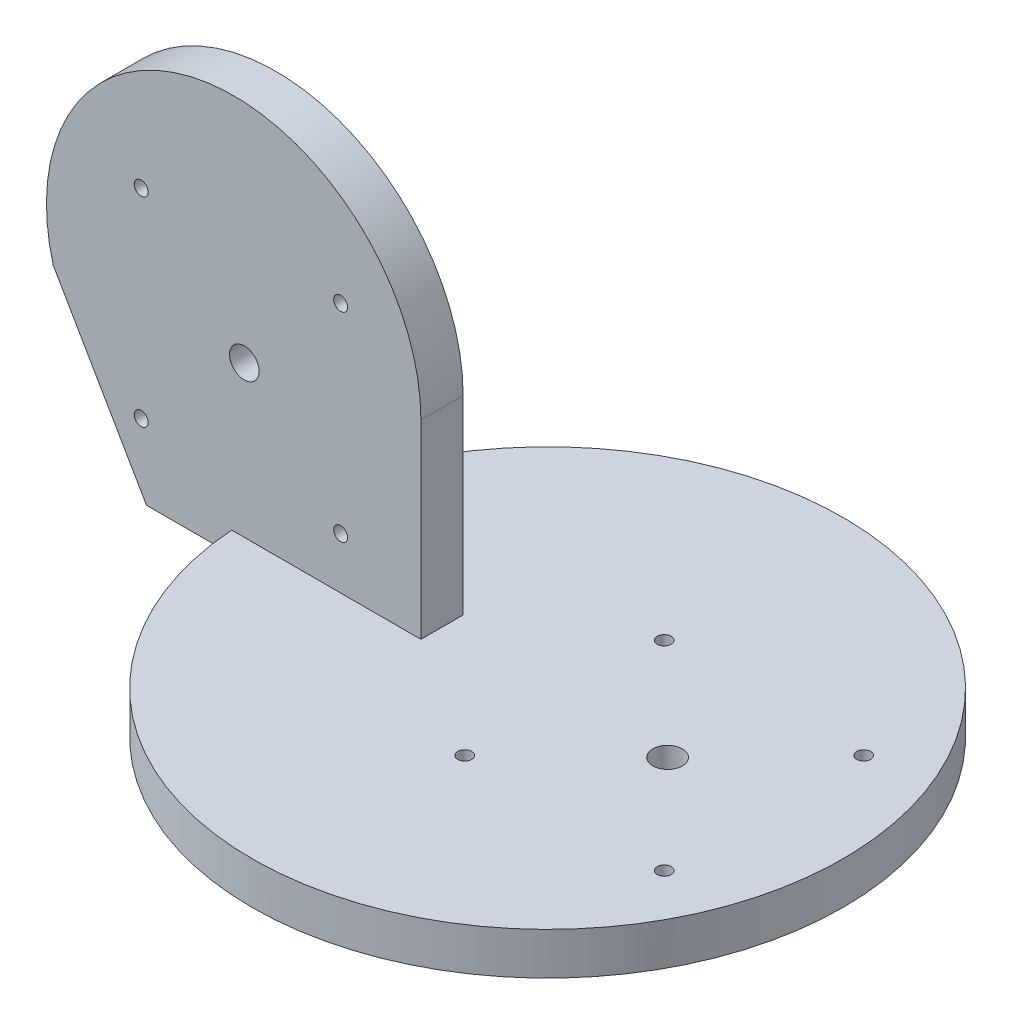
ISO-10303-21;
HEADER;
FILE_DESCRIPTION(('STEP AP214'),'2;1');
FILE_NAME('part.step','',(''),(''),'','','');
FILE_SCHEMA(('AUTOMOTIVE_DESIGN { 1 0 10303 214 1 1 1 1 }'));
ENDSEC;
DATA;
#1=APPLICATION_CONTEXT('core data for automotive mechanical design processes');
#2=APPLICATION_PROTOCOL_DEFINITION('international standard','automotive_design',2000,#1);
#3=PRODUCT_CONTEXT('',#1,'mechanical');
#4=PRODUCT('Part','Part','',(#3));
#5=PRODUCT_RELATED_PRODUCT_CATEGORY('part','',(#4));
#6=PRODUCT_DEFINITION_FORMATION('','',#4);
#7=PRODUCT_DEFINITION_CONTEXT('part definition',#1,'design');
#8=PRODUCT_DEFINITION('design','',#6,#7);
#9=PRODUCT_DEFINITION_SHAPE('','',#8);
#10=(LENGTH_UNIT() NAMED_UNIT(*) SI_UNIT(.MILLI.,.METRE.));
#11=(NAMED_UNIT(*) PLANE_ANGLE_UNIT() SI_UNIT($,.RADIAN.));
#12=(NAMED_UNIT(*) SI_UNIT($,.STERADIAN.) SOLID_ANGLE_UNIT());
#13=UNCERTAINTY_MEASURE_WITH_UNIT(LENGTH_MEASURE(1.E-05),#10,'distance_accuracy_value','');
#14=(GEOMETRIC_REPRESENTATION_CONTEXT(3) GLOBAL_UNCERTAINTY_ASSIGNED_CONTEXT((#13)) GLOBAL_UNIT_ASSIGNED_CONTEXT((#10,
#11,#12)) REPRESENTATION_CONTEXT('',''));
#15=CARTESIAN_POINT('',(0.,0.,0.));
#16=DIRECTION('',(0.,0.,1.));
#17=DIRECTION('',(1.,0.,0.));
#18=AXIS2_PLACEMENT_3D('',#15,#16,#17);
#19=CARTESIAN_POINT('',(0.,10.,0.));
#20=DIRECTION('',(0.,-1.,0.));
#21=DIRECTION('',(0.,0.,-1.));
#22=AXIS2_PLACEMENT_3D('',#19,#20,#21);
#23=CYLINDRICAL_SURFACE('',#22,70.);
#24=CARTESIAN_POINT('',(0.,0.,0.));
#25=DIRECTION('',(0.,1.,0.));
#26=DIRECTION('',(0.,0.,1.));
#27=AXIS2_PLACEMENT_3D('',#24,#25,#26);
#28=CIRCLE('',#27,70.);
#29=CARTESIAN_POINT('',(0.,0.,70.));
#30=VERTEX_POINT('',#29);
#31=EDGE_CURVE('E169',#30,#30,#28,.T.);
#32=ORIENTED_EDGE('',*,*,#31,.T.);
#33=EDGE_LOOP('',(#32));
#34=FACE_BOUND('',#33,.T.);
#35=DIRECTION('',(0.,-1.,0.));
#36=VECTOR('',#35,1.);
#37=CARTESIAN_POINT('',(-69.8212002188447,10.,5.));
#38=LINE('',#37,#36);
#39=CARTESIAN_POINT('',(-69.8212002188447,4.99999999999999,5.));
#40=VERTEX_POINT('',#39);
#41=CARTESIAN_POINT('',(-69.8212002188447,10.,5.));
#42=VERTEX_POINT('',#41);
#43=EDGE_CURVE('E53',#40,#42,#38,.F.);
#44=ORIENTED_EDGE('',*,*,#43,.F.);
#45=CARTESIAN_POINT('',(0.,5.,0.));
#46=DIRECTION('',(0.,1.,0.));
#47=DIRECTION('',(-1.,0.,0.));
#48=AXIS2_PLACEMENT_3D('',#45,#46,#47);
#49=CIRCLE('',#48,70.);
#50=CARTESIAN_POINT('',(-69.8212002188447,4.99999999999999,-5.));
#51=VERTEX_POINT('',#50);
#52=EDGE_CURVE('E11',#51,#40,#49,.T.);
#53=ORIENTED_EDGE('',*,*,#52,.F.);
#54=DIRECTION('',(0.,-1.,0.));
#55=VECTOR('',#54,1.);
#56=CARTESIAN_POINT('',(-69.8212002188447,10.,-5.));
#57=LINE('',#56,#55);
#58=CARTESIAN_POINT('',(-69.8212002188447,10.,-5.));
#59=VERTEX_POINT('',#58);
#60=EDGE_CURVE('E163',#51,#59,#57,.F.);
#61=ORIENTED_EDGE('',*,*,#60,.T.);
#62=CARTESIAN_POINT('',(0.,10.,0.));
#63=DIRECTION('',(0.,1.,0.));
#64=DIRECTION('',(0.,0.,1.));
#65=AXIS2_PLACEMENT_3D('',#62,#63,#64);
#66=CIRCLE('',#65,70.);
#67=EDGE_CURVE('E174',#42,#59,#66,.T.);
#68=ORIENTED_EDGE('',*,*,#67,.F.);
#69=EDGE_LOOP('',(#44,#53,#61,#68));
#70=FACE_BOUND('',#69,.T.);
#71=ADVANCED_FACE('F38',(#34,#70),#23,.T.);
#72=CARTESIAN_POINT('',(0.,10.,0.));
#73=DIRECTION('',(0.,1.,0.));
#74=DIRECTION('',(0.,0.,1.));
#75=AXIS2_PLACEMENT_3D('',#72,#73,#74);
#76=PLANE('',#75);
#77=CARTESIAN_POINT('',(28.4267988565162,10.,0.));
#78=DIRECTION('',(0.,1.,0.));
#79=DIRECTION('',(0.,0.,1.));
#80=AXIS2_PLACEMENT_3D('',#77,#78,#79);
#81=CIRCLE('',#80,3.49999999999999);
#82=CARTESIAN_POINT('',(28.4267988565162,10.,3.49999999999999));
#83=VERTEX_POINT('',#82);
#84=EDGE_CURVE('E252',#83,#83,#81,.T.);
#85=ORIENTED_EDGE('',*,*,#84,.F.);
#86=EDGE_LOOP('',(#85));
#87=FACE_BOUND('',#86,.T.);
#88=CARTESIAN_POINT('',(3.99999999999997,10.,-23.622));
#89=DIRECTION('',(0.,1.,0.));
#90=DIRECTION('',(0.,0.,1.));
#91=AXIS2_PLACEMENT_3D('',#88,#89,#90);
#92=CIRCLE('',#91,1.64999999999999);
#93=CARTESIAN_POINT('',(3.99999999999997,10.,-21.972));
#94=VERTEX_POINT('',#93);
#95=EDGE_CURVE('E110',#94,#94,#92,.T.);
#96=ORIENTED_EDGE('',*,*,#95,.F.);
#97=EDGE_LOOP('',(#96));
#98=FACE_BOUND('',#97,.T.);
#99=CARTESIAN_POINT('',(51.244,10.,-23.622));
#100=DIRECTION('',(0.,1.,0.));
#101=DIRECTION('',(0.,0.,1.));
#102=AXIS2_PLACEMENT_3D('',#99,#100,#101);
#103=CIRCLE('',#102,1.64999999999999);
#104=CARTESIAN_POINT('',(51.244,10.,-21.972));
#105=VERTEX_POINT('',#104);
#106=EDGE_CURVE('E109',#105,#105,#103,.T.);
#107=ORIENTED_EDGE('',*,*,#106,.F.);
#108=EDGE_LOOP('',(#107));
#109=FACE_BOUND('',#108,.T.);
#110=CARTESIAN_POINT('',(51.244,10.,23.622));
#111=DIRECTION('',(0.,1.,0.));
#112=DIRECTION('',(0.,0.,1.));
#113=AXIS2_PLACEMENT_3D('',#110,#111,#112);
#114=CIRCLE('',#113,1.64999999999999);
#115=CARTESIAN_POINT('',(51.244,10.,25.272));
#116=VERTEX_POINT('',#115);
#117=EDGE_CURVE('E122',#116,#116,#114,.T.);
#118=ORIENTED_EDGE('',*,*,#117,.F.);
#119=EDGE_LOOP('',(#118));
#120=FACE_BOUND('',#119,.T.);
#121=CARTESIAN_POINT('',(4.,10.,23.622));
#122=DIRECTION('',(0.,1.,0.));
#123=DIRECTION('',(0.,0.,1.));
#124=AXIS2_PLACEMENT_3D('',#121,#122,#123);
#125=CIRCLE('',#124,1.64999999999999);
#126=CARTESIAN_POINT('',(4.,10.,25.272));
#127=VERTEX_POINT('',#126);
#128=EDGE_CURVE('E128',#127,#127,#125,.T.);
#129=ORIENTED_EDGE('',*,*,#128,.F.);
#130=EDGE_LOOP('',(#129));
#131=FACE_BOUND('',#130,.T.);
#132=DIRECTION('',(0.,0.,1.));
#133=VECTOR('',#132,1.);
#134=CARTESIAN_POINT('',(-25.,10.,0.));
#135=LINE('',#134,#133);
#136=CARTESIAN_POINT('',(-25.,10.,-5.));
#137=VERTEX_POINT('',#136);
#138=CARTESIAN_POINT('',(-25.,10.,5.));
#139=VERTEX_POINT('',#138);
#140=EDGE_CURVE('E180',#137,#139,#135,.T.);
#141=ORIENTED_EDGE('',*,*,#140,.T.);
#142=DIRECTION('',(-1.,0.,0.));
#143=VECTOR('',#142,1.);
#144=CARTESIAN_POINT('',(0.,10.,5.));
#145=LINE('',#144,#143);
#146=EDGE_CURVE('E46',#139,#42,#145,.T.);
#147=ORIENTED_EDGE('',*,*,#146,.T.);
#148=ORIENTED_EDGE('',*,*,#67,.T.);
#149=DIRECTION('',(-1.,0.,0.));
#150=VECTOR('',#149,1.);
#151=CARTESIAN_POINT('',(0.,10.,-5.));
#152=LINE('',#151,#150);
#153=EDGE_CURVE('E173',#137,#59,#152,.T.);
#154=ORIENTED_EDGE('',*,*,#153,.F.);
#155=EDGE_LOOP('',(#141,#147,#148,#154));
#156=FACE_BOUND('',#155,.T.);
#157=ADVANCED_FACE('F184',(#87,#98,#109,#120,#131,#156),#76,.T.);
#158=CARTESIAN_POINT('',(0.,0.,0.));
#159=DIRECTION('',(0.,1.,0.));
#160=DIRECTION('',(0.,0.,1.));
#161=AXIS2_PLACEMENT_3D('',#158,#159,#160);
#162=PLANE('',#161);
#163=CARTESIAN_POINT('',(0.,0.,0.));
#164=DIRECTION('',(0.,-1.,0.));
#165=DIRECTION('',(0.,0.,-1.));
#166=AXIS2_PLACEMENT_3D('',#163,#164,#165);
#167=CIRCLE('',#166,65.);
#168=CARTESIAN_POINT('',(0.,0.,-65.));
#169=VERTEX_POINT('',#168);
#170=EDGE_CURVE('E170',#169,#169,#167,.T.);
#171=ORIENTED_EDGE('',*,*,#170,.F.);
#172=EDGE_LOOP('',(#171));
#173=FACE_BOUND('',#172,.T.);
#174=ORIENTED_EDGE('',*,*,#31,.F.);
#175=EDGE_LOOP('',(#174));
#176=FACE_BOUND('',#175,.T.);
#177=ADVANCED_FACE('F221',(#173,#176),#162,.F.);
#178=CARTESIAN_POINT('',(0.,-3.,0.));
#179=DIRECTION('',(0.,1.,0.));
#180=DIRECTION('',(0.,0.,1.));
#181=AXIS2_PLACEMENT_3D('',#178,#179,#180);
#182=CYLINDRICAL_SURFACE('',#181,65.);
#183=CARTESIAN_POINT('',(0.,-3.,0.));
#184=DIRECTION('',(0.,-1.,0.));
#185=DIRECTION('',(0.,0.,-1.));
#186=AXIS2_PLACEMENT_3D('',#183,#184,#185);
#187=CIRCLE('',#186,65.);
#188=CARTESIAN_POINT('',(0.,-3.,-65.));
#189=VERTEX_POINT('',#188);
#190=EDGE_CURVE('E166',#189,#189,#187,.T.);
#191=ORIENTED_EDGE('',*,*,#190,.F.);
#192=EDGE_LOOP('',(#191));
#193=FACE_BOUND('',#192,.T.);
#194=ORIENTED_EDGE('',*,*,#170,.T.);
#195=EDGE_LOOP('',(#194));
#196=FACE_BOUND('',#195,.T.);
#197=ADVANCED_FACE('F227',(#193,#196),#182,.T.);
#198=CARTESIAN_POINT('',(0.,-3.,0.));
#199=DIRECTION('',(0.,-1.,0.));
#200=DIRECTION('',(0.,0.,-1.));
#201=AXIS2_PLACEMENT_3D('',#198,#199,#200);
#202=PLANE('',#201);
#203=CARTESIAN_POINT('',(28.4267988565162,-3.,0.));
#204=DIRECTION('',(0.,1.,0.));
#205=DIRECTION('',(0.,0.,1.));
#206=AXIS2_PLACEMENT_3D('',#203,#204,#205);
#207=CIRCLE('',#206,3.5);
#208=CARTESIAN_POINT('',(28.4267988565162,-3.,3.5));
#209=VERTEX_POINT('',#208);
#210=EDGE_CURVE('E116',#209,#209,#207,.T.);
#211=ORIENTED_EDGE('',*,*,#210,.T.);
#212=EDGE_LOOP('',(#211));
#213=FACE_BOUND('',#212,.T.);
#214=ORIENTED_EDGE('',*,*,#190,.T.);
#215=EDGE_LOOP('',(#214));
#216=FACE_BOUND('',#215,.T.);
#217=ADVANCED_FACE('F232',(#213,#216),#202,.T.);
#218=CARTESIAN_POINT('',(-69.3458475312719,55.,5.));
#219=DIRECTION('',(0.,0.,-1.));
#220=DIRECTION('',(-1.,0.,0.));
#221=AXIS2_PLACEMENT_3D('',#218,#219,#220);
#222=PLANE('',#221);
#223=CARTESIAN_POINT('',(-66.8266224533388,45.7931765020589,5.));
#224=DIRECTION('',(0.,0.,1.));
#225=DIRECTION('',(1.,0.,0.));
#226=AXIS2_PLACEMENT_3D('',#223,#224,#225);
#227=CIRCLE('',#226,3.49999999999999);
#228=CARTESIAN_POINT('',(-63.3266224533388,45.7931765020589,5.));
#229=VERTEX_POINT('',#228);
#230=EDGE_CURVE('E280',#229,#229,#227,.T.);
#231=ORIENTED_EDGE('',*,*,#230,.F.);
#232=EDGE_LOOP('',(#231));
#233=FACE_BOUND('',#232,.T.);
#234=CARTESIAN_POINT('',(-91.253421309855,69.4151765020589,5.));
#235=DIRECTION('',(0.,0.,1.));
#236=DIRECTION('',(1.,0.,0.));
#237=AXIS2_PLACEMENT_3D('',#234,#235,#236);
#238=CIRCLE('',#237,1.64999999999998);
#239=CARTESIAN_POINT('',(-89.603421309855,69.4151765020589,5.));
#240=VERTEX_POINT('',#239);
#241=EDGE_CURVE('E274',#240,#240,#238,.T.);
#242=ORIENTED_EDGE('',*,*,#241,.F.);
#243=EDGE_LOOP('',(#242));
#244=FACE_BOUND('',#243,.T.);
#245=CARTESIAN_POINT('',(-44.009421309855,69.4151765020589,5.));
#246=DIRECTION('',(0.,0.,1.));
#247=DIRECTION('',(1.,0.,0.));
#248=AXIS2_PLACEMENT_3D('',#245,#246,#247);
#249=CIRCLE('',#248,1.64999999999999);
#250=CARTESIAN_POINT('',(-42.359421309855,69.4151765020589,5.));
#251=VERTEX_POINT('',#250);
#252=EDGE_CURVE('E268',#251,#251,#249,.T.);
#253=ORIENTED_EDGE('',*,*,#252,.F.);
#254=EDGE_LOOP('',(#253));
#255=FACE_BOUND('',#254,.T.);
#256=CARTESIAN_POINT('',(-44.009421309855,22.1711765020589,5.));
#257=DIRECTION('',(0.,0.,1.));
#258=DIRECTION('',(1.,0.,0.));
#259=AXIS2_PLACEMENT_3D('',#256,#257,#258);
#260=CIRCLE('',#259,1.64999999999999);
#261=CARTESIAN_POINT('',(-42.359421309855,22.1711765020589,5.));
#262=VERTEX_POINT('',#261);
#263=EDGE_CURVE('E262',#262,#262,#260,.T.);
#264=ORIENTED_EDGE('',*,*,#263,.F.);
#265=EDGE_LOOP('',(#264));
#266=FACE_BOUND('',#265,.T.);
#267=CARTESIAN_POINT('',(-91.253421309855,22.1711765020589,5.));
#268=DIRECTION('',(0.,0.,1.));
#269=DIRECTION('',(1.,0.,0.));
#270=AXIS2_PLACEMENT_3D('',#267,#268,#269);
#271=CIRCLE('',#270,1.64999999999998);
#272=CARTESIAN_POINT('',(-89.603421309855,22.1711765020589,5.));
#273=VERTEX_POINT('',#272);
#274=EDGE_CURVE('E259',#273,#273,#271,.T.);
#275=ORIENTED_EDGE('',*,*,#274,.F.);
#276=EDGE_LOOP('',(#275));
#277=FACE_BOUND('',#276,.T.);
#278=DIRECTION('',(1.,0.,0.));
#279=VECTOR('',#278,1.);
#280=CARTESIAN_POINT('',(-25.,4.99999999999999,5.));
#281=LINE('',#280,#279);
#282=CARTESIAN_POINT('',(-90.,4.99999999999999,5.));
#283=VERTEX_POINT('',#282);
#284=EDGE_CURVE('E141',#283,#40,#281,.T.);
#285=ORIENTED_EDGE('',*,*,#284,.T.);
#286=ORIENTED_EDGE('',*,*,#43,.T.);
#287=ORIENTED_EDGE('',*,*,#146,.F.);
#288=DIRECTION('',(0.,1.,0.));
#289=VECTOR('',#288,1.);
#290=CARTESIAN_POINT('',(-25.,55.,5.));
#291=LINE('',#290,#289);
#292=CARTESIAN_POINT('',(-25.,55.,5.));
#293=VERTEX_POINT('',#292);
#294=EDGE_CURVE('E144',#139,#293,#291,.T.);
#295=ORIENTED_EDGE('',*,*,#294,.T.);
#296=CARTESIAN_POINT('',(-69.3458475312719,55.,5.));
#297=DIRECTION('',(0.,0.,1.));
#298=DIRECTION('',(-1.,0.,0.));
#299=AXIS2_PLACEMENT_3D('',#296,#297,#298);
#300=CIRCLE('',#299,44.3458475312719);
#301=CARTESIAN_POINT('',(-112.09425777106,43.204763027493,5.));
#302=VERTEX_POINT('',#301);
#303=EDGE_CURVE('E135',#293,#302,#300,.T.);
#304=ORIENTED_EDGE('',*,*,#303,.T.);
#305=DIRECTION('',(0.500624015179347,-0.865664828571491,0.));
#306=VECTOR('',#305,1.);
#307=CARTESIAN_POINT('',(-90.,4.99999999999999,5.));
#308=LINE('',#307,#306);
#309=EDGE_CURVE('E138',#302,#283,#308,.T.);
#310=ORIENTED_EDGE('',*,*,#309,.T.);
#311=EDGE_LOOP('',(#285,#286,#287,#295,#304,#310));
#312=FACE_BOUND('',#311,.T.);
#313=ADVANCED_FACE('F188',(#233,#244,#255,#266,#277,#312),#222,.F.);
#314=CARTESIAN_POINT('',(-69.3458475312719,55.,-5.));
#315=DIRECTION('',(0.,0.,-1.));
#316=DIRECTION('',(-1.,0.,0.));
#317=AXIS2_PLACEMENT_3D('',#314,#315,#316);
#318=PLANE('',#317);
#319=CARTESIAN_POINT('',(-66.8266224533388,45.7931765020589,-5.));
#320=DIRECTION('',(0.,0.,-1.));
#321=DIRECTION('',(-1.,0.,0.));
#322=AXIS2_PLACEMENT_3D('',#319,#320,#321);
#323=CIRCLE('',#322,3.49999999999999);
#324=CARTESIAN_POINT('',(-70.3266224533387,45.7931765020589,-5.));
#325=VERTEX_POINT('',#324);
#326=EDGE_CURVE('E277',#325,#325,#323,.T.);
#327=ORIENTED_EDGE('',*,*,#326,.F.);
#328=EDGE_LOOP('',(#327));
#329=FACE_BOUND('',#328,.T.);
#330=CARTESIAN_POINT('',(-91.253421309855,69.4151765020589,-5.));
#331=DIRECTION('',(0.,0.,-1.));
#332=DIRECTION('',(-1.,0.,0.));
#333=AXIS2_PLACEMENT_3D('',#330,#331,#332);
#334=CIRCLE('',#333,1.64999999999998);
#335=CARTESIAN_POINT('',(-92.903421309855,69.4151765020589,-5.));
#336=VERTEX_POINT('',#335);
#337=EDGE_CURVE('E271',#336,#336,#334,.T.);
#338=ORIENTED_EDGE('',*,*,#337,.F.);
#339=EDGE_LOOP('',(#338));
#340=FACE_BOUND('',#339,.T.);
#341=CARTESIAN_POINT('',(-44.009421309855,69.4151765020589,-5.));
#342=DIRECTION('',(0.,0.,-1.));
#343=DIRECTION('',(-1.,0.,0.));
#344=AXIS2_PLACEMENT_3D('',#341,#342,#343);
#345=CIRCLE('',#344,1.64999999999999);
#346=CARTESIAN_POINT('',(-45.659421309855,69.4151765020589,-5.));
#347=VERTEX_POINT('',#346);
#348=EDGE_CURVE('E265',#347,#347,#345,.T.);
#349=ORIENTED_EDGE('',*,*,#348,.F.);
#350=EDGE_LOOP('',(#349));
#351=FACE_BOUND('',#350,.T.);
#352=CARTESIAN_POINT('',(-44.009421309855,22.1711765020589,-5.));
#353=DIRECTION('',(0.,0.,-1.));
#354=DIRECTION('',(-1.,0.,0.));
#355=AXIS2_PLACEMENT_3D('',#352,#353,#354);
#356=CIRCLE('',#355,1.64999999999999);
#357=CARTESIAN_POINT('',(-45.659421309855,22.1711765020589,-5.));
#358=VERTEX_POINT('',#357);
#359=EDGE_CURVE('E41',#358,#358,#356,.T.);
#360=ORIENTED_EDGE('',*,*,#359,.F.);
#361=EDGE_LOOP('',(#360));
#362=FACE_BOUND('',#361,.T.);
#363=CARTESIAN_POINT('',(-91.253421309855,22.1711765020589,-5.));
#364=DIRECTION('',(0.,0.,-1.));
#365=DIRECTION('',(-1.,0.,0.));
#366=AXIS2_PLACEMENT_3D('',#363,#364,#365);
#367=CIRCLE('',#366,1.64999999999998);
#368=CARTESIAN_POINT('',(-92.903421309855,22.1711765020589,-5.));
#369=VERTEX_POINT('',#368);
#370=EDGE_CURVE('E254',#369,#369,#367,.T.);
#371=ORIENTED_EDGE('',*,*,#370,.F.);
#372=EDGE_LOOP('',(#371));
#373=FACE_BOUND('',#372,.T.);
#374=ORIENTED_EDGE('',*,*,#60,.F.);
#375=DIRECTION('',(1.,0.,0.));
#376=VECTOR('',#375,1.);
#377=CARTESIAN_POINT('',(-25.,4.99999999999999,-5.));
#378=LINE('',#377,#376);
#379=CARTESIAN_POINT('',(-90.,4.99999999999999,-5.));
#380=VERTEX_POINT('',#379);
#381=EDGE_CURVE('E151',#380,#51,#378,.T.);
#382=ORIENTED_EDGE('',*,*,#381,.F.);
#383=DIRECTION('',(0.500624015179347,-0.865664828571491,0.));
#384=VECTOR('',#383,1.);
#385=CARTESIAN_POINT('',(-90.,4.99999999999999,-5.));
#386=LINE('',#385,#384);
#387=CARTESIAN_POINT('',(-112.09425777106,43.204763027493,-5.));
#388=VERTEX_POINT('',#387);
#389=EDGE_CURVE('E149',#388,#380,#386,.T.);
#390=ORIENTED_EDGE('',*,*,#389,.F.);
#391=CARTESIAN_POINT('',(-69.3458475312719,55.,-5.));
#392=DIRECTION('',(0.,0.,1.));
#393=DIRECTION('',(-1.,0.,0.));
#394=AXIS2_PLACEMENT_3D('',#391,#392,#393);
#395=CIRCLE('',#394,44.3458475312719);
#396=CARTESIAN_POINT('',(-25.,55.,-5.));
#397=VERTEX_POINT('',#396);
#398=EDGE_CURVE('E134',#397,#388,#395,.T.);
#399=ORIENTED_EDGE('',*,*,#398,.F.);
#400=DIRECTION('',(0.,1.,0.));
#401=VECTOR('',#400,1.);
#402=CARTESIAN_POINT('',(-25.,55.,-5.));
#403=LINE('',#402,#401);
#404=EDGE_CURVE('E139',#137,#397,#403,.T.);
#405=ORIENTED_EDGE('',*,*,#404,.F.);
#406=ORIENTED_EDGE('',*,*,#153,.T.);
#407=EDGE_LOOP('',(#374,#382,#390,#399,#405,#406));
#408=FACE_BOUND('',#407,.T.);
#409=ADVANCED_FACE('F195',(#329,#340,#351,#362,#373,#408),#318,.T.);
#410=CARTESIAN_POINT('',(-69.3458475312719,55.,5.));
#411=DIRECTION('',(0.,0.,-1.));
#412=DIRECTION('',(-1.,0.,0.));
#413=AXIS2_PLACEMENT_3D('',#410,#411,#412);
#414=CYLINDRICAL_SURFACE('',#413,44.3458475312719);
#415=ORIENTED_EDGE('',*,*,#398,.T.);
#416=DIRECTION('',(0.,0.,-1.));
#417=VECTOR('',#416,1.);
#418=CARTESIAN_POINT('',(-112.09425777106,43.204763027493,5.));
#419=LINE('',#418,#417);
#420=EDGE_CURVE('E160',#302,#388,#419,.T.);
#421=ORIENTED_EDGE('',*,*,#420,.F.);
#422=ORIENTED_EDGE('',*,*,#303,.F.);
#423=DIRECTION('',(0.,0.,-1.));
#424=VECTOR('',#423,1.);
#425=CARTESIAN_POINT('',(-25.,55.,5.));
#426=LINE('',#425,#424);
#427=EDGE_CURVE('E146',#293,#397,#426,.T.);
#428=ORIENTED_EDGE('',*,*,#427,.T.);
#429=EDGE_LOOP('',(#415,#421,#422,#428));
#430=FACE_BOUND('',#429,.T.);
#431=ADVANCED_FACE('F204',(#430),#414,.T.);
#432=CARTESIAN_POINT('',(-90.,4.99999999999999,5.));
#433=DIRECTION('',(0.865664828571491,0.500624015179347,0.));
#434=DIRECTION('',(-0.500624015179347,0.865664828571491,0.));
#435=AXIS2_PLACEMENT_3D('',#432,#433,#434);
#436=PLANE('',#435);
#437=ORIENTED_EDGE('',*,*,#389,.T.);
#438=DIRECTION('',(0.,0.,-1.));
#439=VECTOR('',#438,1.);
#440=CARTESIAN_POINT('',(-90.,4.99999999999999,5.));
#441=LINE('',#440,#439);
#442=EDGE_CURVE('E157',#283,#380,#441,.T.);
#443=ORIENTED_EDGE('',*,*,#442,.F.);
#444=ORIENTED_EDGE('',*,*,#309,.F.);
#445=ORIENTED_EDGE('',*,*,#420,.T.);
#446=EDGE_LOOP('',(#437,#443,#444,#445));
#447=FACE_BOUND('',#446,.T.);
#448=ADVANCED_FACE('F206',(#447),#436,.F.);
#449=CARTESIAN_POINT('',(-25.,4.99999999999999,5.));
#450=DIRECTION('',(0.,1.,0.));
#451=DIRECTION('',(-1.,0.,0.));
#452=AXIS2_PLACEMENT_3D('',#449,#450,#451);
#453=PLANE('',#452);
#454=ORIENTED_EDGE('',*,*,#381,.T.);
#455=ORIENTED_EDGE('',*,*,#52,.T.);
#456=ORIENTED_EDGE('',*,*,#284,.F.);
#457=ORIENTED_EDGE('',*,*,#442,.T.);
#458=EDGE_LOOP('',(#454,#455,#456,#457));
#459=FACE_BOUND('',#458,.T.);
#460=ADVANCED_FACE('F192',(#459),#453,.F.);
#461=CARTESIAN_POINT('',(-25.,55.,5.));
#462=DIRECTION('',(-1.,0.,0.));
#463=DIRECTION('',(0.,-1.,0.));
#464=AXIS2_PLACEMENT_3D('',#461,#462,#463);
#465=PLANE('',#464);
#466=ORIENTED_EDGE('',*,*,#140,.F.);
#467=ORIENTED_EDGE('',*,*,#404,.T.);
#468=ORIENTED_EDGE('',*,*,#427,.F.);
#469=ORIENTED_EDGE('',*,*,#294,.F.);
#470=EDGE_LOOP('',(#466,#467,#468,#469));
#471=FACE_BOUND('',#470,.T.);
#472=ADVANCED_FACE('F199',(#471),#465,.F.);
#473=CARTESIAN_POINT('',(4.,-0.0999999999999977,23.622));
#474=DIRECTION('',(0.,1.,0.));
#475=DIRECTION('',(0.,0.,1.));
#476=AXIS2_PLACEMENT_3D('',#473,#474,#475);
#477=CONICAL_SURFACE('',#476,1.64999999999999,1.02974425867665);
#478=CARTESIAN_POINT('',(4.,-1.09142002139547,23.622));
#479=VERTEX_POINT('',#478);
#480=VERTEX_LOOP('',#479);
#481=FACE_BOUND('',#480,.T.);
#482=CARTESIAN_POINT('',(4.,-0.0999999999999977,23.622));
#483=DIRECTION('',(0.,1.,0.));
#484=DIRECTION('',(0.,0.,1.));
#485=AXIS2_PLACEMENT_3D('',#482,#483,#484);
#486=CIRCLE('',#485,1.64999999999999);
#487=CARTESIAN_POINT('',(4.,-0.0999999999999977,25.272));
#488=VERTEX_POINT('',#487);
#489=EDGE_CURVE('E131',#488,#488,#486,.T.);
#490=ORIENTED_EDGE('',*,*,#489,.T.);
#491=EDGE_LOOP('',(#490));
#492=FACE_BOUND('',#491,.T.);
#493=ADVANCED_FACE('F330',(#481,#492),#477,.F.);
#494=CARTESIAN_POINT('',(4.,10.,23.622));
#495=DIRECTION('',(0.,1.,0.));
#496=DIRECTION('',(0.,0.,1.));
#497=AXIS2_PLACEMENT_3D('',#494,#495,#496);
#498=CYLINDRICAL_SURFACE('',#497,1.64999999999999);
#499=ORIENTED_EDGE('',*,*,#489,.F.);
#500=EDGE_LOOP('',(#499));
#501=FACE_BOUND('',#500,.T.);
#502=ORIENTED_EDGE('',*,*,#128,.T.);
#503=EDGE_LOOP('',(#502));
#504=FACE_BOUND('',#503,.T.);
#505=ADVANCED_FACE('F326',(#501,#504),#498,.F.);
#506=CARTESIAN_POINT('',(51.244,-0.0999999999999977,23.622));
#507=DIRECTION('',(0.,1.,0.));
#508=DIRECTION('',(0.,0.,1.));
#509=AXIS2_PLACEMENT_3D('',#506,#507,#508);
#510=CONICAL_SURFACE('',#509,1.64999999999998,1.02974425867665);
#511=CARTESIAN_POINT('',(51.244,-1.09142002139547,23.622));
#512=VERTEX_POINT('',#511);
#513=VERTEX_LOOP('',#512);
#514=FACE_BOUND('',#513,.T.);
#515=CARTESIAN_POINT('',(51.244,-0.0999999999999977,23.622));
#516=DIRECTION('',(0.,1.,0.));
#517=DIRECTION('',(0.,0.,1.));
#518=AXIS2_PLACEMENT_3D('',#515,#516,#517);
#519=CIRCLE('',#518,1.64999999999998);
#520=CARTESIAN_POINT('',(51.244,-0.0999999999999977,25.272));
#521=VERTEX_POINT('',#520);
#522=EDGE_CURVE('E125',#521,#521,#519,.T.);
#523=ORIENTED_EDGE('',*,*,#522,.T.);
#524=EDGE_LOOP('',(#523));
#525=FACE_BOUND('',#524,.T.);
#526=ADVANCED_FACE('F322',(#514,#525),#510,.F.);
#527=CARTESIAN_POINT('',(51.244,10.,23.622));
#528=DIRECTION('',(0.,1.,0.));
#529=DIRECTION('',(0.,0.,1.));
#530=AXIS2_PLACEMENT_3D('',#527,#528,#529);
#531=CYLINDRICAL_SURFACE('',#530,1.64999999999999);
#532=ORIENTED_EDGE('',*,*,#522,.F.);
#533=EDGE_LOOP('',(#532));
#534=FACE_BOUND('',#533,.T.);
#535=ORIENTED_EDGE('',*,*,#117,.T.);
#536=EDGE_LOOP('',(#535));
#537=FACE_BOUND('',#536,.T.);
#538=ADVANCED_FACE('F318',(#534,#537),#531,.F.);
#539=CARTESIAN_POINT('',(51.244,-0.0999999999999977,-23.622));
#540=DIRECTION('',(0.,1.,0.));
#541=DIRECTION('',(0.,0.,1.));
#542=AXIS2_PLACEMENT_3D('',#539,#540,#541);
#543=CONICAL_SURFACE('',#542,1.64999999999998,1.02974425867665);
#544=CARTESIAN_POINT('',(51.244,-1.09142002139547,-23.622));
#545=VERTEX_POINT('',#544);
#546=VERTEX_LOOP('',#545);
#547=FACE_BOUND('',#546,.T.);
#548=CARTESIAN_POINT('',(51.244,-0.0999999999999977,-23.622));
#549=DIRECTION('',(0.,1.,0.));
#550=DIRECTION('',(0.,0.,1.));
#551=AXIS2_PLACEMENT_3D('',#548,#549,#550);
#552=CIRCLE('',#551,1.64999999999998);
#553=CARTESIAN_POINT('',(51.244,-0.0999999999999977,-21.972));
#554=VERTEX_POINT('',#553);
#555=EDGE_CURVE('E113',#554,#554,#552,.T.);
#556=ORIENTED_EDGE('',*,*,#555,.T.);
#557=EDGE_LOOP('',(#556));
#558=FACE_BOUND('',#557,.T.);
#559=ADVANCED_FACE('F314',(#547,#558),#543,.F.);
#560=CARTESIAN_POINT('',(51.244,10.,-23.622));
#561=DIRECTION('',(0.,1.,0.));
#562=DIRECTION('',(0.,0.,1.));
#563=AXIS2_PLACEMENT_3D('',#560,#561,#562);
#564=CYLINDRICAL_SURFACE('',#563,1.64999999999999);
#565=ORIENTED_EDGE('',*,*,#555,.F.);
#566=EDGE_LOOP('',(#565));
#567=FACE_BOUND('',#566,.T.);
#568=ORIENTED_EDGE('',*,*,#106,.T.);
#569=EDGE_LOOP('',(#568));
#570=FACE_BOUND('',#569,.T.);
#571=ADVANCED_FACE('F103',(#567,#570),#564,.F.);
#572=CARTESIAN_POINT('',(3.99999999999997,-0.0999999999999977,-23.622));
#573=DIRECTION('',(0.,1.,0.));
#574=DIRECTION('',(0.,0.,1.));
#575=AXIS2_PLACEMENT_3D('',#572,#573,#574);
#576=CONICAL_SURFACE('',#575,1.64999999999999,1.02974425867665);
#577=CARTESIAN_POINT('',(3.99999999999997,-1.09142002139547,-23.622));
#578=VERTEX_POINT('',#577);
#579=VERTEX_LOOP('',#578);
#580=FACE_BOUND('',#579,.T.);
#581=CARTESIAN_POINT('',(3.99999999999997,-0.0999999999999977,-23.622));
#582=DIRECTION('',(0.,1.,0.));
#583=DIRECTION('',(0.,0.,1.));
#584=AXIS2_PLACEMENT_3D('',#581,#582,#583);
#585=CIRCLE('',#584,1.64999999999999);
#586=CARTESIAN_POINT('',(3.99999999999997,-0.0999999999999977,-21.972));
#587=VERTEX_POINT('',#586);
#588=EDGE_CURVE('E107',#587,#587,#585,.T.);
#589=ORIENTED_EDGE('',*,*,#588,.T.);
#590=EDGE_LOOP('',(#589));
#591=FACE_BOUND('',#590,.T.);
#592=ADVANCED_FACE('F99',(#580,#591),#576,.F.);
#593=CARTESIAN_POINT('',(3.99999999999997,10.,-23.622));
#594=DIRECTION('',(0.,1.,0.));
#595=DIRECTION('',(0.,0.,1.));
#596=AXIS2_PLACEMENT_3D('',#593,#594,#595);
#597=CYLINDRICAL_SURFACE('',#596,1.64999999999999);
#598=ORIENTED_EDGE('',*,*,#588,.F.);
#599=EDGE_LOOP('',(#598));
#600=FACE_BOUND('',#599,.T.);
#601=ORIENTED_EDGE('',*,*,#95,.T.);
#602=EDGE_LOOP('',(#601));
#603=FACE_BOUND('',#602,.T.);
#604=ADVANCED_FACE('F102',(#600,#603),#597,.F.);
#605=CARTESIAN_POINT('',(28.4267988565162,10.,0.));
#606=DIRECTION('',(0.,1.,0.));
#607=DIRECTION('',(0.,0.,1.));
#608=AXIS2_PLACEMENT_3D('',#605,#606,#607);
#609=CYLINDRICAL_SURFACE('',#608,3.49999999999999);
#610=ORIENTED_EDGE('',*,*,#210,.F.);
#611=EDGE_LOOP('',(#610));
#612=FACE_BOUND('',#611,.T.);
#613=ORIENTED_EDGE('',*,*,#84,.T.);
#614=EDGE_LOOP('',(#613));
#615=FACE_BOUND('',#614,.T.);
#616=ADVANCED_FACE('F297',(#612,#615),#609,.F.);
#617=CARTESIAN_POINT('',(-91.253421309855,22.1711765020589,5.));
#618=DIRECTION('',(0.,0.,1.));
#619=DIRECTION('',(1.,0.,0.));
#620=AXIS2_PLACEMENT_3D('',#617,#618,#619);
#621=CYLINDRICAL_SURFACE('',#620,1.64999999999998);
#622=ORIENTED_EDGE('',*,*,#370,.T.);
#623=EDGE_LOOP('',(#622));
#624=FACE_BOUND('',#623,.T.);
#625=ORIENTED_EDGE('',*,*,#274,.T.);
#626=EDGE_LOOP('',(#625));
#627=FACE_BOUND('',#626,.T.);
#628=ADVANCED_FACE('F294',(#624,#627),#621,.F.);
#629=CARTESIAN_POINT('',(-44.009421309855,22.1711765020589,5.));
#630=DIRECTION('',(0.,0.,1.));
#631=DIRECTION('',(1.,0.,0.));
#632=AXIS2_PLACEMENT_3D('',#629,#630,#631);
#633=CYLINDRICAL_SURFACE('',#632,1.64999999999999);
#634=ORIENTED_EDGE('',*,*,#359,.T.);
#635=EDGE_LOOP('',(#634));
#636=FACE_BOUND('',#635,.T.);
#637=ORIENTED_EDGE('',*,*,#263,.T.);
#638=EDGE_LOOP('',(#637));
#639=FACE_BOUND('',#638,.T.);
#640=ADVANCED_FACE('F296',(#636,#639),#633,.F.);
#641=CARTESIAN_POINT('',(-44.009421309855,69.4151765020589,5.));
#642=DIRECTION('',(0.,0.,1.));
#643=DIRECTION('',(1.,0.,0.));
#644=AXIS2_PLACEMENT_3D('',#641,#642,#643);
#645=CYLINDRICAL_SURFACE('',#644,1.64999999999999);
#646=ORIENTED_EDGE('',*,*,#348,.T.);
#647=EDGE_LOOP('',(#646));
#648=FACE_BOUND('',#647,.T.);
#649=ORIENTED_EDGE('',*,*,#252,.T.);
#650=EDGE_LOOP('',(#649));
#651=FACE_BOUND('',#650,.T.);
#652=ADVANCED_FACE('F304',(#648,#651),#645,.F.);
#653=CARTESIAN_POINT('',(-91.253421309855,69.4151765020589,5.));
#654=DIRECTION('',(0.,0.,1.));
#655=DIRECTION('',(1.,0.,0.));
#656=AXIS2_PLACEMENT_3D('',#653,#654,#655);
#657=CYLINDRICAL_SURFACE('',#656,1.64999999999998);
#658=ORIENTED_EDGE('',*,*,#337,.T.);
#659=EDGE_LOOP('',(#658));
#660=FACE_BOUND('',#659,.T.);
#661=ORIENTED_EDGE('',*,*,#241,.T.);
#662=EDGE_LOOP('',(#661));
#663=FACE_BOUND('',#662,.T.);
#664=ADVANCED_FACE('F437',(#660,#663),#657,.F.);
#665=CARTESIAN_POINT('',(-66.8266224533388,45.7931765020589,5.));
#666=DIRECTION('',(0.,0.,1.));
#667=DIRECTION('',(1.,0.,0.));
#668=AXIS2_PLACEMENT_3D('',#665,#666,#667);
#669=CYLINDRICAL_SURFACE('',#668,3.49999999999999);
#670=ORIENTED_EDGE('',*,*,#326,.T.);
#671=EDGE_LOOP('',(#670));
#672=FACE_BOUND('',#671,.T.);
#673=ORIENTED_EDGE('',*,*,#230,.T.);
#674=EDGE_LOOP('',(#673));
#675=FACE_BOUND('',#674,.T.);
#676=ADVANCED_FACE('F284',(#672,#675),#669,.F.);
#677=CLOSED_SHELL('',(#71,#157,#177,#197,#217,#313,#409,#431,#448,#460,#472,#493,#505,#526,#538,
#559,#571,#592,#604,#616,#628,#640,#652,#664,#676));
#678=MANIFOLD_SOLID_BREP('B2',#677);
#679=ADVANCED_BREP_SHAPE_REPRESENTATION('',(#18,#678),#14);
#680=SHAPE_DEFINITION_REPRESENTATION(#9,#679);
ENDSEC;
END-ISO-10303-21;
